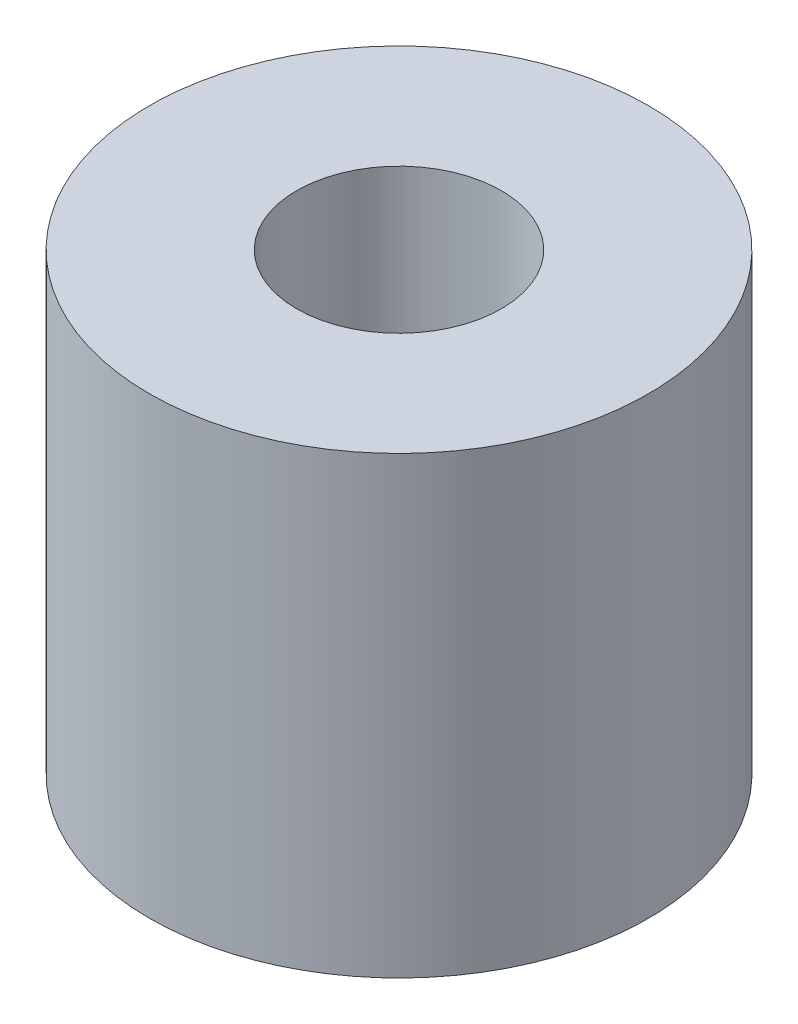
ISO-10303-21;
HEADER;
FILE_DESCRIPTION(('STEP AP214'),'2;1');
FILE_NAME('part.step','',(''),(''),'','','');
FILE_SCHEMA(('AUTOMOTIVE_DESIGN { 1 0 10303 214 1 1 1 1 }'));
ENDSEC;
DATA;
#1=APPLICATION_CONTEXT('core data for automotive mechanical design processes');
#2=APPLICATION_PROTOCOL_DEFINITION('international standard','automotive_design',2000,#1);
#3=PRODUCT_CONTEXT('',#1,'mechanical');
#4=PRODUCT('Part','Part','',(#3));
#5=PRODUCT_RELATED_PRODUCT_CATEGORY('part','',(#4));
#6=PRODUCT_DEFINITION_FORMATION('','',#4);
#7=PRODUCT_DEFINITION_CONTEXT('part definition',#1,'design');
#8=PRODUCT_DEFINITION('design','',#6,#7);
#9=PRODUCT_DEFINITION_SHAPE('','',#8);
#10=(LENGTH_UNIT() NAMED_UNIT(*) SI_UNIT(.MILLI.,.METRE.));
#11=(NAMED_UNIT(*) PLANE_ANGLE_UNIT() SI_UNIT($,.RADIAN.));
#12=(NAMED_UNIT(*) SI_UNIT($,.STERADIAN.) SOLID_ANGLE_UNIT());
#13=UNCERTAINTY_MEASURE_WITH_UNIT(LENGTH_MEASURE(1.E-05),#10,'distance_accuracy_value','');
#14=(GEOMETRIC_REPRESENTATION_CONTEXT(3) GLOBAL_UNCERTAINTY_ASSIGNED_CONTEXT((#13)) GLOBAL_UNIT_ASSIGNED_CONTEXT((#10,
#11,#12)) REPRESENTATION_CONTEXT('',''));
#15=CARTESIAN_POINT('',(0.,0.,0.));
#16=DIRECTION('',(0.,0.,1.));
#17=DIRECTION('',(1.,0.,0.));
#18=AXIS2_PLACEMENT_3D('',#15,#16,#17);
#19=CARTESIAN_POINT('',(0.,7.1,0.));
#20=DIRECTION('',(0.,1.,0.));
#21=DIRECTION('',(0.,0.,1.));
#22=AXIS2_PLACEMENT_3D('',#19,#20,#21);
#23=PLANE('',#22);
#24=CARTESIAN_POINT('',(0.,7.1,0.));
#25=DIRECTION('',(0.,1.,0.));
#26=DIRECTION('',(0.,0.,1.));
#27=AXIS2_PLACEMENT_3D('',#24,#25,#26);
#28=CIRCLE('',#27,3.9);
#29=CARTESIAN_POINT('',(0.,7.1,3.9));
#30=VERTEX_POINT('',#29);
#31=EDGE_CURVE('E10',#30,#30,#28,.T.);
#32=ORIENTED_EDGE('',*,*,#31,.T.);
#33=EDGE_LOOP('',(#32));
#34=FACE_BOUND('',#33,.T.);
#35=CARTESIAN_POINT('',(0.,7.1,0.));
#36=DIRECTION('',(0.,1.,0.));
#37=DIRECTION('',(0.,0.,1.));
#38=AXIS2_PLACEMENT_3D('',#35,#36,#37);
#39=CIRCLE('',#38,1.6);
#40=CARTESIAN_POINT('',(0.,7.1,1.6));
#41=VERTEX_POINT('',#40);
#42=EDGE_CURVE('E46',#41,#41,#39,.T.);
#43=ORIENTED_EDGE('',*,*,#42,.F.);
#44=EDGE_LOOP('',(#43));
#45=FACE_BOUND('',#44,.T.);
#46=ADVANCED_FACE('F35',(#34,#45),#23,.T.);
#47=CARTESIAN_POINT('',(0.,0.,0.));
#48=DIRECTION('',(0.,1.,0.));
#49=DIRECTION('',(0.,0.,1.));
#50=AXIS2_PLACEMENT_3D('',#47,#48,#49);
#51=PLANE('',#50);
#52=CARTESIAN_POINT('',(0.,0.,0.));
#53=DIRECTION('',(0.,1.,0.));
#54=DIRECTION('',(0.,0.,1.));
#55=AXIS2_PLACEMENT_3D('',#52,#53,#54);
#56=CIRCLE('',#55,3.9);
#57=CARTESIAN_POINT('',(0.,0.,3.9));
#58=VERTEX_POINT('',#57);
#59=EDGE_CURVE('E39',#58,#58,#56,.T.);
#60=ORIENTED_EDGE('',*,*,#59,.F.);
#61=EDGE_LOOP('',(#60));
#62=FACE_BOUND('',#61,.T.);
#63=CARTESIAN_POINT('',(0.,0.,0.));
#64=DIRECTION('',(0.,1.,0.));
#65=DIRECTION('',(0.,0.,1.));
#66=AXIS2_PLACEMENT_3D('',#63,#64,#65);
#67=CIRCLE('',#66,1.6);
#68=CARTESIAN_POINT('',(0.,0.,1.6));
#69=VERTEX_POINT('',#68);
#70=EDGE_CURVE('E48',#69,#69,#67,.T.);
#71=ORIENTED_EDGE('',*,*,#70,.T.);
#72=EDGE_LOOP('',(#71));
#73=FACE_BOUND('',#72,.T.);
#74=ADVANCED_FACE('F58',(#62,#73),#51,.F.);
#75=CARTESIAN_POINT('',(0.,7.1,0.));
#76=DIRECTION('',(0.,-1.,0.));
#77=DIRECTION('',(0.,0.,-1.));
#78=AXIS2_PLACEMENT_3D('',#75,#76,#77);
#79=CYLINDRICAL_SURFACE('',#78,3.9);
#80=ORIENTED_EDGE('',*,*,#31,.F.);
#81=EDGE_LOOP('',(#80));
#82=FACE_BOUND('',#81,.T.);
#83=ORIENTED_EDGE('',*,*,#59,.T.);
#84=EDGE_LOOP('',(#83));
#85=FACE_BOUND('',#84,.T.);
#86=ADVANCED_FACE('F37',(#82,#85),#79,.T.);
#87=CARTESIAN_POINT('',(0.,7.1,0.));
#88=DIRECTION('',(0.,-1.,0.));
#89=DIRECTION('',(0.,0.,-1.));
#90=AXIS2_PLACEMENT_3D('',#87,#88,#89);
#91=CYLINDRICAL_SURFACE('',#90,1.6);
#92=ORIENTED_EDGE('',*,*,#42,.T.);
#93=EDGE_LOOP('',(#92));
#94=FACE_BOUND('',#93,.T.);
#95=ORIENTED_EDGE('',*,*,#70,.F.);
#96=EDGE_LOOP('',(#95));
#97=FACE_BOUND('',#96,.T.);
#98=ADVANCED_FACE('F54',(#94,#97),#91,.F.);
#99=CLOSED_SHELL('',(#46,#74,#86,#98));
#100=MANIFOLD_SOLID_BREP('B2',#99);
#101=ADVANCED_BREP_SHAPE_REPRESENTATION('',(#18,#100),#14);
#102=SHAPE_DEFINITION_REPRESENTATION(#9,#101);
ENDSEC;
END-ISO-10303-21;
